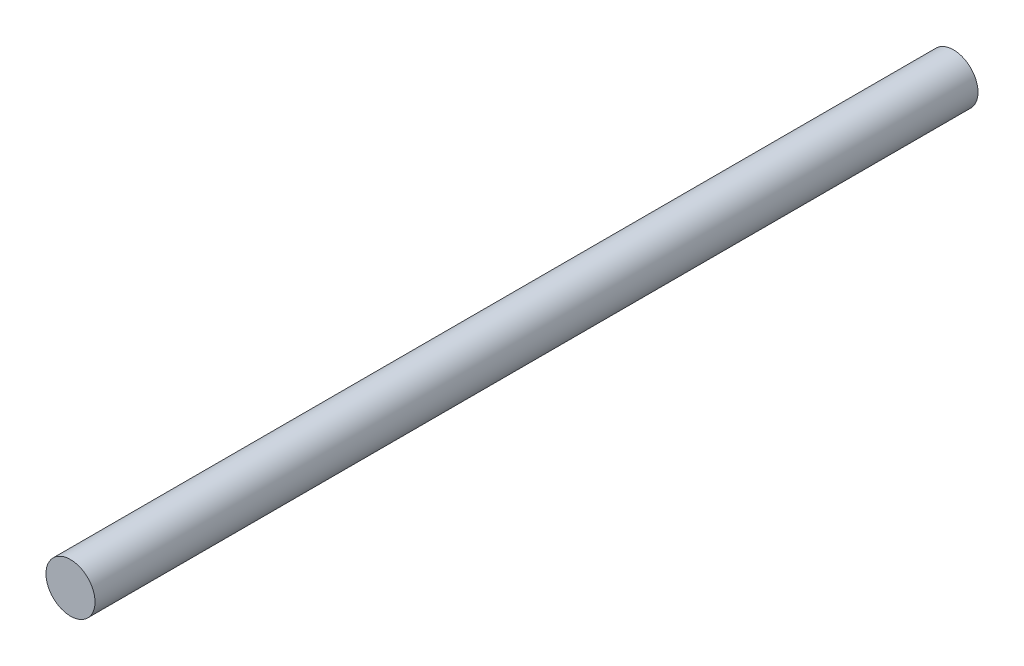
ISO-10303-21;
HEADER;
FILE_DESCRIPTION(('STEP AP214'),'2;1');
FILE_NAME('part.step','',(''),(''),'','','');
FILE_SCHEMA(('AUTOMOTIVE_DESIGN { 1 0 10303 214 1 1 1 1 }'));
ENDSEC;
DATA;
#1=APPLICATION_CONTEXT('core data for automotive mechanical design processes');
#2=APPLICATION_PROTOCOL_DEFINITION('international standard','automotive_design',2000,#1);
#3=PRODUCT_CONTEXT('',#1,'mechanical');
#4=PRODUCT('Part','Part','',(#3));
#5=PRODUCT_RELATED_PRODUCT_CATEGORY('part','',(#4));
#6=PRODUCT_DEFINITION_FORMATION('','',#4);
#7=PRODUCT_DEFINITION_CONTEXT('part definition',#1,'design');
#8=PRODUCT_DEFINITION('design','',#6,#7);
#9=PRODUCT_DEFINITION_SHAPE('','',#8);
#10=(LENGTH_UNIT() NAMED_UNIT(*) SI_UNIT(.MILLI.,.METRE.));
#11=(NAMED_UNIT(*) PLANE_ANGLE_UNIT() SI_UNIT($,.RADIAN.));
#12=(NAMED_UNIT(*) SI_UNIT($,.STERADIAN.) SOLID_ANGLE_UNIT());
#13=UNCERTAINTY_MEASURE_WITH_UNIT(LENGTH_MEASURE(1.E-05),#10,'distance_accuracy_value','');
#14=(GEOMETRIC_REPRESENTATION_CONTEXT(3) GLOBAL_UNCERTAINTY_ASSIGNED_CONTEXT((#13)) GLOBAL_UNIT_ASSIGNED_CONTEXT((#10,
#11,#12)) REPRESENTATION_CONTEXT('',''));
#15=CARTESIAN_POINT('',(0.,0.,0.));
#16=DIRECTION('',(0.,0.,1.));
#17=DIRECTION('',(1.,0.,0.));
#18=AXIS2_PLACEMENT_3D('',#15,#16,#17);
#19=CARTESIAN_POINT('',(0.,0.,57.15));
#20=DIRECTION('',(0.,0.,-1.));
#21=DIRECTION('',(-1.,0.,0.));
#22=AXIS2_PLACEMENT_3D('',#19,#20,#21);
#23=CYLINDRICAL_SURFACE('',#22,3.175);
#24=CARTESIAN_POINT('',(0.,0.,57.15));
#25=DIRECTION('',(0.,0.,1.));
#26=DIRECTION('',(1.,0.,0.));
#27=AXIS2_PLACEMENT_3D('',#24,#25,#26);
#28=CIRCLE('',#27,3.175);
#29=CARTESIAN_POINT('',(3.175,0.,57.15));
#30=VERTEX_POINT('',#29);
#31=EDGE_CURVE('E10',#30,#30,#28,.T.);
#32=ORIENTED_EDGE('',*,*,#31,.F.);
#33=EDGE_LOOP('',(#32));
#34=FACE_BOUND('',#33,.T.);
#35=CARTESIAN_POINT('',(0.,0.,-57.15));
#36=DIRECTION('',(0.,0.,1.));
#37=DIRECTION('',(1.,0.,0.));
#38=AXIS2_PLACEMENT_3D('',#35,#36,#37);
#39=CIRCLE('',#38,3.175);
#40=CARTESIAN_POINT('',(3.175,0.,-57.15));
#41=VERTEX_POINT('',#40);
#42=EDGE_CURVE('E44',#41,#41,#39,.T.);
#43=ORIENTED_EDGE('',*,*,#42,.T.);
#44=EDGE_LOOP('',(#43));
#45=FACE_BOUND('',#44,.T.);
#46=ADVANCED_FACE('F38',(#34,#45),#23,.T.);
#47=CARTESIAN_POINT('',(0.,0.,57.15));
#48=DIRECTION('',(0.,0.,1.));
#49=DIRECTION('',(1.,0.,0.));
#50=AXIS2_PLACEMENT_3D('',#47,#48,#49);
#51=PLANE('',#50);
#52=ORIENTED_EDGE('',*,*,#31,.T.);
#53=EDGE_LOOP('',(#52));
#54=FACE_BOUND('',#53,.T.);
#55=ADVANCED_FACE('F53',(#54),#51,.T.);
#56=CARTESIAN_POINT('',(0.,0.,-57.15));
#57=DIRECTION('',(0.,0.,1.));
#58=DIRECTION('',(1.,0.,0.));
#59=AXIS2_PLACEMENT_3D('',#56,#57,#58);
#60=PLANE('',#59);
#61=ORIENTED_EDGE('',*,*,#42,.F.);
#62=EDGE_LOOP('',(#61));
#63=FACE_BOUND('',#62,.T.);
#64=ADVANCED_FACE('F51',(#63),#60,.F.);
#65=CLOSED_SHELL('',(#46,#55,#64));
#66=MANIFOLD_SOLID_BREP('B2',#65);
#67=ADVANCED_BREP_SHAPE_REPRESENTATION('',(#18,#66),#14);
#68=SHAPE_DEFINITION_REPRESENTATION(#9,#67);
ENDSEC;
END-ISO-10303-21;
